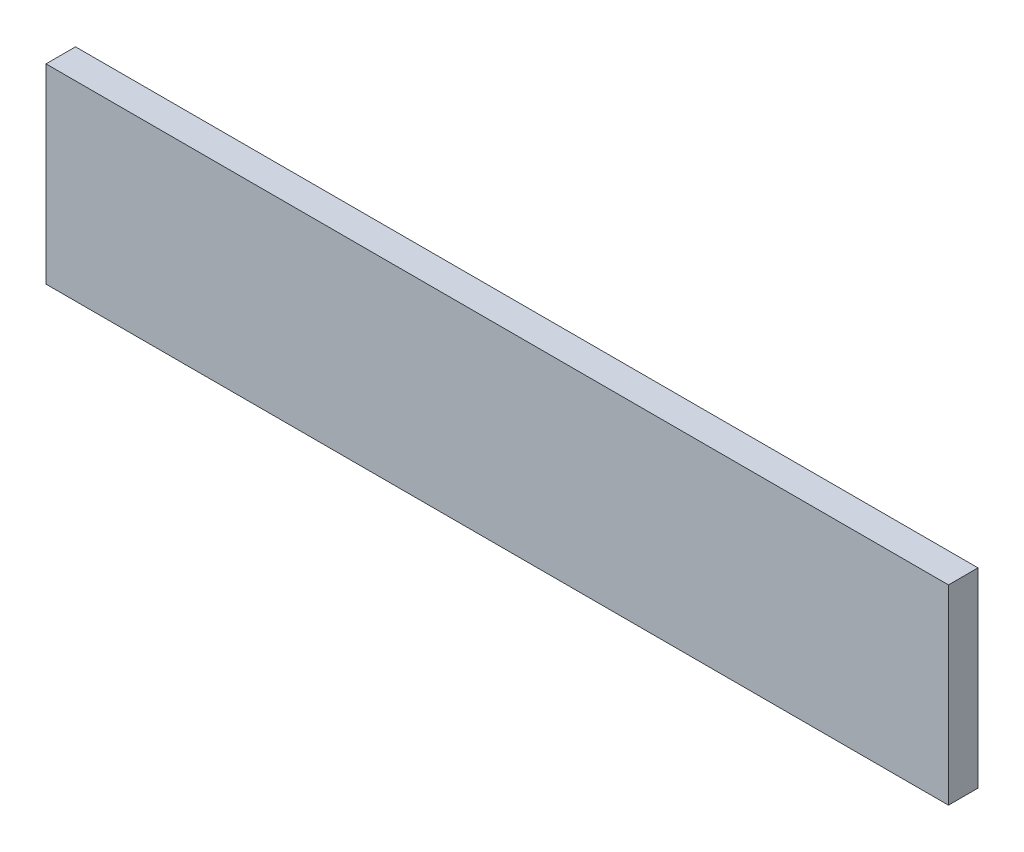
ISO-10303-21;
HEADER;
FILE_DESCRIPTION(('STEP AP214'),'2;1');
FILE_NAME('part.step','',(''),(''),'','','');
FILE_SCHEMA(('AUTOMOTIVE_DESIGN { 1 0 10303 214 1 1 1 1 }'));
ENDSEC;
DATA;
#1=APPLICATION_CONTEXT('core data for automotive mechanical design processes');
#2=APPLICATION_PROTOCOL_DEFINITION('international standard','automotive_design',2000,#1);
#3=PRODUCT_CONTEXT('',#1,'mechanical');
#4=PRODUCT('Part','Part','',(#3));
#5=PRODUCT_RELATED_PRODUCT_CATEGORY('part','',(#4));
#6=PRODUCT_DEFINITION_FORMATION('','',#4);
#7=PRODUCT_DEFINITION_CONTEXT('part definition',#1,'design');
#8=PRODUCT_DEFINITION('design','',#6,#7);
#9=PRODUCT_DEFINITION_SHAPE('','',#8);
#10=(LENGTH_UNIT() NAMED_UNIT(*) SI_UNIT(.MILLI.,.METRE.));
#11=(NAMED_UNIT(*) PLANE_ANGLE_UNIT() SI_UNIT($,.RADIAN.));
#12=(NAMED_UNIT(*) SI_UNIT($,.STERADIAN.) SOLID_ANGLE_UNIT());
#13=UNCERTAINTY_MEASURE_WITH_UNIT(LENGTH_MEASURE(1.E-05),#10,'distance_accuracy_value','');
#14=(GEOMETRIC_REPRESENTATION_CONTEXT(3) GLOBAL_UNCERTAINTY_ASSIGNED_CONTEXT((#13)) GLOBAL_UNIT_ASSIGNED_CONTEXT((#10,
#11,#12)) REPRESENTATION_CONTEXT('',''));
#15=CARTESIAN_POINT('',(0.,0.,0.));
#16=DIRECTION('',(0.,0.,1.));
#17=DIRECTION('',(1.,0.,0.));
#18=AXIS2_PLACEMENT_3D('',#15,#16,#17);
#19=CARTESIAN_POINT('',(0.,33.271694214876,3.5));
#20=DIRECTION('',(0.,1.,0.));
#21=DIRECTION('',(0.,0.,1.));
#22=AXIS2_PLACEMENT_3D('',#19,#20,#21);
#23=PLANE('',#22);
#24=DIRECTION('',(1.,0.,0.));
#25=VECTOR('',#24,1.);
#26=CARTESIAN_POINT('',(0.,33.271694214876,0.));
#27=LINE('',#26,#25);
#28=CARTESIAN_POINT('',(-40.6776859504132,33.271694214876,0.));
#29=VERTEX_POINT('',#28);
#30=CARTESIAN_POINT('',(66.3223140495868,33.271694214876,0.));
#31=VERTEX_POINT('',#30);
#32=EDGE_CURVE('E131',#29,#31,#27,.T.);
#33=ORIENTED_EDGE('',*,*,#32,.F.);
#34=DIRECTION('',(0.,0.,-1.));
#35=VECTOR('',#34,1.);
#36=CARTESIAN_POINT('',(-40.6776859504132,33.271694214876,3.5));
#37=LINE('',#36,#35);
#38=CARTESIAN_POINT('',(-40.6776859504132,33.271694214876,3.5));
#39=VERTEX_POINT('',#38);
#40=EDGE_CURVE('E89',#39,#29,#37,.T.);
#41=ORIENTED_EDGE('',*,*,#40,.F.);
#42=DIRECTION('',(1.,0.,0.));
#43=VECTOR('',#42,1.);
#44=CARTESIAN_POINT('',(0.,33.271694214876,3.5));
#45=LINE('',#44,#43);
#46=CARTESIAN_POINT('',(66.3223140495868,33.271694214876,3.5));
#47=VERTEX_POINT('',#46);
#48=EDGE_CURVE('E129',#39,#47,#45,.T.);
#49=ORIENTED_EDGE('',*,*,#48,.T.);
#50=DIRECTION('',(0.,0.,-1.));
#51=VECTOR('',#50,1.);
#52=CARTESIAN_POINT('',(66.3223140495868,33.271694214876,3.5));
#53=LINE('',#52,#51);
#54=EDGE_CURVE('E12',#47,#31,#53,.T.);
#55=ORIENTED_EDGE('',*,*,#54,.T.);
#56=EDGE_LOOP('',(#33,#41,#49,#55));
#57=FACE_BOUND('',#56,.T.);
#58=ADVANCED_FACE('F80',(#57),#23,.T.);
#59=CARTESIAN_POINT('',(-40.6776859504132,0.,3.5));
#60=DIRECTION('',(1.,0.,0.));
#61=DIRECTION('',(0.,1.,0.));
#62=AXIS2_PLACEMENT_3D('',#59,#60,#61);
#63=PLANE('',#62);
#64=DIRECTION('',(0.,-1.,0.));
#65=VECTOR('',#64,1.);
#66=CARTESIAN_POINT('',(-40.6776859504132,0.,0.));
#67=LINE('',#66,#65);
#68=CARTESIAN_POINT('',(-40.6776859504132,10.651694214876,0.));
#69=VERTEX_POINT('',#68);
#70=EDGE_CURVE('E150',#29,#69,#67,.T.);
#71=ORIENTED_EDGE('',*,*,#70,.T.);
#72=DIRECTION('',(0.,0.,-1.));
#73=VECTOR('',#72,1.);
#74=CARTESIAN_POINT('',(-40.6776859504132,10.651694214876,3.5));
#75=LINE('',#74,#73);
#76=CARTESIAN_POINT('',(-40.6776859504132,10.651694214876,3.5));
#77=VERTEX_POINT('',#76);
#78=EDGE_CURVE('E134',#77,#69,#75,.T.);
#79=ORIENTED_EDGE('',*,*,#78,.F.);
#80=DIRECTION('',(0.,-1.,0.));
#81=VECTOR('',#80,1.);
#82=CARTESIAN_POINT('',(-40.6776859504132,0.,3.5));
#83=LINE('',#82,#81);
#84=EDGE_CURVE('E136',#39,#77,#83,.T.);
#85=ORIENTED_EDGE('',*,*,#84,.F.);
#86=ORIENTED_EDGE('',*,*,#40,.T.);
#87=EDGE_LOOP('',(#71,#79,#85,#86));
#88=FACE_BOUND('',#87,.T.);
#89=ADVANCED_FACE('F137',(#88),#63,.F.);
#90=CARTESIAN_POINT('',(0.,10.651694214876,3.5));
#91=DIRECTION('',(0.,1.,0.));
#92=DIRECTION('',(0.,0.,1.));
#93=AXIS2_PLACEMENT_3D('',#90,#91,#92);
#94=PLANE('',#93);
#95=DIRECTION('',(1.,0.,0.));
#96=VECTOR('',#95,1.);
#97=CARTESIAN_POINT('',(0.,10.651694214876,0.));
#98=LINE('',#97,#96);
#99=CARTESIAN_POINT('',(66.3223140495868,10.651694214876,0.));
#100=VERTEX_POINT('',#99);
#101=EDGE_CURVE('E113',#69,#100,#98,.T.);
#102=ORIENTED_EDGE('',*,*,#101,.T.);
#103=DIRECTION('',(0.,0.,-1.));
#104=VECTOR('',#103,1.);
#105=CARTESIAN_POINT('',(66.3223140495868,10.651694214876,3.5));
#106=LINE('',#105,#104);
#107=CARTESIAN_POINT('',(66.3223140495868,10.651694214876,3.5));
#108=VERTEX_POINT('',#107);
#109=EDGE_CURVE('E120',#108,#100,#106,.T.);
#110=ORIENTED_EDGE('',*,*,#109,.F.);
#111=DIRECTION('',(1.,0.,0.));
#112=VECTOR('',#111,1.);
#113=CARTESIAN_POINT('',(0.,10.651694214876,3.5));
#114=LINE('',#113,#112);
#115=EDGE_CURVE('E97',#77,#108,#114,.T.);
#116=ORIENTED_EDGE('',*,*,#115,.F.);
#117=ORIENTED_EDGE('',*,*,#78,.T.);
#118=EDGE_LOOP('',(#102,#110,#116,#117));
#119=FACE_BOUND('',#118,.T.);
#120=ADVANCED_FACE('F155',(#119),#94,.F.);
#121=CARTESIAN_POINT('',(66.3223140495868,0.,3.5));
#122=DIRECTION('',(1.,0.,0.));
#123=DIRECTION('',(0.,1.,0.));
#124=AXIS2_PLACEMENT_3D('',#121,#122,#123);
#125=PLANE('',#124);
#126=DIRECTION('',(0.,-1.,0.));
#127=VECTOR('',#126,1.);
#128=CARTESIAN_POINT('',(66.3223140495868,0.,0.));
#129=LINE('',#128,#127);
#130=EDGE_CURVE('E146',#31,#100,#129,.T.);
#131=ORIENTED_EDGE('',*,*,#130,.F.);
#132=ORIENTED_EDGE('',*,*,#54,.F.);
#133=DIRECTION('',(0.,-1.,0.));
#134=VECTOR('',#133,1.);
#135=CARTESIAN_POINT('',(66.3223140495868,0.,3.5));
#136=LINE('',#135,#134);
#137=EDGE_CURVE('E140',#47,#108,#136,.T.);
#138=ORIENTED_EDGE('',*,*,#137,.T.);
#139=ORIENTED_EDGE('',*,*,#109,.T.);
#140=EDGE_LOOP('',(#131,#132,#138,#139));
#141=FACE_BOUND('',#140,.T.);
#142=ADVANCED_FACE('F82',(#141),#125,.T.);
#143=CARTESIAN_POINT('',(0.,0.,0.));
#144=DIRECTION('',(0.,0.,1.));
#145=DIRECTION('',(1.,0.,0.));
#146=AXIS2_PLACEMENT_3D('',#143,#144,#145);
#147=PLANE('',#146);
#148=CARTESIAN_POINT('',(50.3223140495868,17.551694214876,0.));
#149=DIRECTION('',(0.,0.,1.));
#150=DIRECTION('',(1.,0.,0.));
#151=AXIS2_PLACEMENT_3D('',#148,#149,#150);
#152=CIRCLE('',#151,3.5);
#153=CARTESIAN_POINT('',(53.8223140495868,17.551694214876,0.));
#154=VERTEX_POINT('',#153);
#155=EDGE_CURVE('E245',#154,#154,#152,.T.);
#156=ORIENTED_EDGE('',*,*,#155,.T.);
#157=EDGE_LOOP('',(#156));
#158=FACE_BOUND('',#157,.T.);
#159=CARTESIAN_POINT('',(32.3223140495868,17.551694214876,0.));
#160=DIRECTION('',(0.,0.,1.));
#161=DIRECTION('',(1.,0.,0.));
#162=AXIS2_PLACEMENT_3D('',#159,#160,#161);
#163=CIRCLE('',#162,3.5);
#164=CARTESIAN_POINT('',(35.8223140495868,17.551694214876,0.));
#165=VERTEX_POINT('',#164);
#166=EDGE_CURVE('E251',#165,#165,#163,.T.);
#167=ORIENTED_EDGE('',*,*,#166,.T.);
#168=EDGE_LOOP('',(#167));
#169=FACE_BOUND('',#168,.T.);
#170=CARTESIAN_POINT('',(14.3223140495868,17.551694214876,0.));
#171=DIRECTION('',(0.,0.,1.));
#172=DIRECTION('',(1.,0.,0.));
#173=AXIS2_PLACEMENT_3D('',#170,#171,#172);
#174=CIRCLE('',#173,3.5);
#175=CARTESIAN_POINT('',(17.8223140495868,17.551694214876,0.));
#176=VERTEX_POINT('',#175);
#177=EDGE_CURVE('E254',#176,#176,#174,.T.);
#178=ORIENTED_EDGE('',*,*,#177,.T.);
#179=EDGE_LOOP('',(#178));
#180=FACE_BOUND('',#179,.T.);
#181=ORIENTED_EDGE('',*,*,#130,.T.);
#182=ORIENTED_EDGE('',*,*,#101,.F.);
#183=ORIENTED_EDGE('',*,*,#70,.F.);
#184=ORIENTED_EDGE('',*,*,#32,.T.);
#185=EDGE_LOOP('',(#181,#182,#183,#184));
#186=FACE_BOUND('',#185,.T.);
#187=ADVANCED_FACE('F156',(#158,#169,#180,#186),#147,.F.);
#188=CARTESIAN_POINT('',(0.,0.,3.5));
#189=DIRECTION('',(0.,0.,1.));
#190=DIRECTION('',(1.,0.,0.));
#191=AXIS2_PLACEMENT_3D('',#188,#189,#190);
#192=PLANE('',#191);
#193=ORIENTED_EDGE('',*,*,#137,.F.);
#194=ORIENTED_EDGE('',*,*,#48,.F.);
#195=ORIENTED_EDGE('',*,*,#84,.T.);
#196=ORIENTED_EDGE('',*,*,#115,.T.);
#197=EDGE_LOOP('',(#193,#194,#195,#196));
#198=FACE_BOUND('',#197,.T.);
#199=ADVANCED_FACE('F139',(#198),#192,.T.);
#200=CARTESIAN_POINT('',(14.3223140495868,17.551694214876,-2.));
#201=DIRECTION('',(0.,0.,1.));
#202=DIRECTION('',(1.,0.,0.));
#203=AXIS2_PLACEMENT_3D('',#200,#201,#202);
#204=CYLINDRICAL_SURFACE('',#203,3.5);
#205=CARTESIAN_POINT('',(14.3223140495868,17.551694214876,-2.));
#206=DIRECTION('',(0.,0.,1.));
#207=DIRECTION('',(1.,0.,0.));
#208=AXIS2_PLACEMENT_3D('',#205,#206,#207);
#209=CIRCLE('',#208,3.5);
#210=CARTESIAN_POINT('',(17.8223140495868,17.551694214876,-2.));
#211=VERTEX_POINT('',#210);
#212=EDGE_CURVE('E148',#211,#211,#209,.T.);
#213=ORIENTED_EDGE('',*,*,#212,.T.);
#214=EDGE_LOOP('',(#213));
#215=FACE_BOUND('',#214,.T.);
#216=ORIENTED_EDGE('',*,*,#177,.F.);
#217=EDGE_LOOP('',(#216));
#218=FACE_BOUND('',#217,.T.);
#219=ADVANCED_FACE('F173',(#215,#218),#204,.T.);
#220=CARTESIAN_POINT('',(14.3223140495868,17.551694214876,-2.));
#221=DIRECTION('',(0.,0.,1.));
#222=DIRECTION('',(1.,0.,0.));
#223=AXIS2_PLACEMENT_3D('',#220,#221,#222);
#224=PLANE('',#223);
#225=CARTESIAN_POINT('',(14.3223140495868,17.551694214876,-2.));
#226=DIRECTION('',(0.,0.,1.));
#227=DIRECTION('',(1.,0.,0.));
#228=AXIS2_PLACEMENT_3D('',#225,#226,#227);
#229=CIRCLE('',#228,1.5);
#230=CARTESIAN_POINT('',(15.8223140495868,17.551694214876,-2.));
#231=VERTEX_POINT('',#230);
#232=EDGE_CURVE('E232',#231,#231,#229,.T.);
#233=ORIENTED_EDGE('',*,*,#232,.T.);
#234=EDGE_LOOP('',(#233));
#235=FACE_BOUND('',#234,.T.);
#236=ORIENTED_EDGE('',*,*,#212,.F.);
#237=EDGE_LOOP('',(#236));
#238=FACE_BOUND('',#237,.T.);
#239=ADVANCED_FACE('F176',(#235,#238),#224,.F.);
#240=CARTESIAN_POINT('',(32.3223140495868,17.551694214876,-2.));
#241=DIRECTION('',(0.,0.,1.));
#242=DIRECTION('',(1.,0.,0.));
#243=AXIS2_PLACEMENT_3D('',#240,#241,#242);
#244=CYLINDRICAL_SURFACE('',#243,3.5);
#245=CARTESIAN_POINT('',(32.3223140495868,17.551694214876,-2.));
#246=DIRECTION('',(0.,0.,1.));
#247=DIRECTION('',(1.,0.,0.));
#248=AXIS2_PLACEMENT_3D('',#245,#246,#247);
#249=CIRCLE('',#248,3.5);
#250=CARTESIAN_POINT('',(35.8223140495868,17.551694214876,-2.));
#251=VERTEX_POINT('',#250);
#252=EDGE_CURVE('E248',#251,#251,#249,.T.);
#253=ORIENTED_EDGE('',*,*,#252,.T.);
#254=EDGE_LOOP('',(#253));
#255=FACE_BOUND('',#254,.T.);
#256=ORIENTED_EDGE('',*,*,#166,.F.);
#257=EDGE_LOOP('',(#256));
#258=FACE_BOUND('',#257,.T.);
#259=ADVANCED_FACE('F180',(#255,#258),#244,.T.);
#260=CARTESIAN_POINT('',(32.3223140495868,17.551694214876,-2.));
#261=DIRECTION('',(0.,0.,1.));
#262=DIRECTION('',(1.,0.,0.));
#263=AXIS2_PLACEMENT_3D('',#260,#261,#262);
#264=PLANE('',#263);
#265=CARTESIAN_POINT('',(32.3223140495868,17.551694214876,-2.));
#266=DIRECTION('',(0.,0.,1.));
#267=DIRECTION('',(1.,0.,0.));
#268=AXIS2_PLACEMENT_3D('',#265,#266,#267);
#269=CIRCLE('',#268,1.5);
#270=CARTESIAN_POINT('',(33.8223140495868,17.551694214876,-2.));
#271=VERTEX_POINT('',#270);
#272=EDGE_CURVE('E225',#271,#271,#269,.T.);
#273=ORIENTED_EDGE('',*,*,#272,.T.);
#274=EDGE_LOOP('',(#273));
#275=FACE_BOUND('',#274,.T.);
#276=ORIENTED_EDGE('',*,*,#252,.F.);
#277=EDGE_LOOP('',(#276));
#278=FACE_BOUND('',#277,.T.);
#279=ADVANCED_FACE('F182',(#275,#278),#264,.F.);
#280=CARTESIAN_POINT('',(50.3223140495868,17.551694214876,-2.));
#281=DIRECTION('',(0.,0.,1.));
#282=DIRECTION('',(1.,0.,0.));
#283=AXIS2_PLACEMENT_3D('',#280,#281,#282);
#284=CYLINDRICAL_SURFACE('',#283,3.5);
#285=CARTESIAN_POINT('',(50.3223140495868,17.551694214876,-2.));
#286=DIRECTION('',(0.,0.,1.));
#287=DIRECTION('',(1.,0.,0.));
#288=AXIS2_PLACEMENT_3D('',#285,#286,#287);
#289=CIRCLE('',#288,3.5);
#290=CARTESIAN_POINT('',(53.8223140495868,17.551694214876,-2.));
#291=VERTEX_POINT('',#290);
#292=EDGE_CURVE('E243',#291,#291,#289,.T.);
#293=ORIENTED_EDGE('',*,*,#292,.T.);
#294=EDGE_LOOP('',(#293));
#295=FACE_BOUND('',#294,.T.);
#296=ORIENTED_EDGE('',*,*,#155,.F.);
#297=EDGE_LOOP('',(#296));
#298=FACE_BOUND('',#297,.T.);
#299=ADVANCED_FACE('F185',(#295,#298),#284,.T.);
#300=CARTESIAN_POINT('',(50.3223140495868,17.551694214876,-2.));
#301=DIRECTION('',(0.,0.,1.));
#302=DIRECTION('',(1.,0.,0.));
#303=AXIS2_PLACEMENT_3D('',#300,#301,#302);
#304=PLANE('',#303);
#305=CARTESIAN_POINT('',(50.3223140495868,17.551694214876,-2.));
#306=DIRECTION('',(0.,0.,1.));
#307=DIRECTION('',(1.,0.,0.));
#308=AXIS2_PLACEMENT_3D('',#305,#306,#307);
#309=CIRCLE('',#308,1.5);
#310=CARTESIAN_POINT('',(51.8223140495868,17.551694214876,-2.));
#311=VERTEX_POINT('',#310);
#312=EDGE_CURVE('E239',#311,#311,#309,.T.);
#313=ORIENTED_EDGE('',*,*,#312,.T.);
#314=EDGE_LOOP('',(#313));
#315=FACE_BOUND('',#314,.T.);
#316=ORIENTED_EDGE('',*,*,#292,.F.);
#317=EDGE_LOOP('',(#316));
#318=FACE_BOUND('',#317,.T.);
#319=ADVANCED_FACE('F190',(#315,#318),#304,.F.);
#320=CARTESIAN_POINT('',(14.3223140495868,17.551694214876,-2.));
#321=DIRECTION('',(0.,0.,1.));
#322=DIRECTION('',(1.,0.,0.));
#323=AXIS2_PLACEMENT_3D('',#320,#321,#322);
#324=CYLINDRICAL_SURFACE('',#323,1.5);
#325=ORIENTED_EDGE('',*,*,#232,.F.);
#326=EDGE_LOOP('',(#325));
#327=FACE_BOUND('',#326,.T.);
#328=CARTESIAN_POINT('',(14.3223140495868,17.551694214876,0.));
#329=DIRECTION('',(0.,0.,1.));
#330=DIRECTION('',(1.,0.,0.));
#331=AXIS2_PLACEMENT_3D('',#328,#329,#330);
#332=CIRCLE('',#331,1.5);
#333=CARTESIAN_POINT('',(15.8223140495868,17.551694214876,0.));
#334=VERTEX_POINT('',#333);
#335=EDGE_CURVE('E229',#334,#334,#332,.T.);
#336=ORIENTED_EDGE('',*,*,#335,.T.);
#337=EDGE_LOOP('',(#336));
#338=FACE_BOUND('',#337,.T.);
#339=ADVANCED_FACE('F193',(#327,#338),#324,.F.);
#340=CARTESIAN_POINT('',(14.3223140495868,17.551694214876,0.));
#341=DIRECTION('',(0.,0.,1.));
#342=DIRECTION('',(1.,0.,0.));
#343=AXIS2_PLACEMENT_3D('',#340,#341,#342);
#344=PLANE('',#343);
#345=ORIENTED_EDGE('',*,*,#335,.F.);
#346=EDGE_LOOP('',(#345));
#347=FACE_BOUND('',#346,.T.);
#348=ADVANCED_FACE('F200',(#347),#344,.F.);
#349=CARTESIAN_POINT('',(50.3223140495868,17.551694214876,-2.));
#350=DIRECTION('',(0.,0.,1.));
#351=DIRECTION('',(1.,0.,0.));
#352=AXIS2_PLACEMENT_3D('',#349,#350,#351);
#353=CYLINDRICAL_SURFACE('',#352,1.5);
#354=ORIENTED_EDGE('',*,*,#312,.F.);
#355=EDGE_LOOP('',(#354));
#356=FACE_BOUND('',#355,.T.);
#357=CARTESIAN_POINT('',(50.3223140495868,17.551694214876,0.));
#358=DIRECTION('',(0.,0.,1.));
#359=DIRECTION('',(1.,0.,0.));
#360=AXIS2_PLACEMENT_3D('',#357,#358,#359);
#361=CIRCLE('',#360,1.5);
#362=CARTESIAN_POINT('',(51.8223140495868,17.551694214876,0.));
#363=VERTEX_POINT('',#362);
#364=EDGE_CURVE('E234',#363,#363,#361,.T.);
#365=ORIENTED_EDGE('',*,*,#364,.T.);
#366=EDGE_LOOP('',(#365));
#367=FACE_BOUND('',#366,.T.);
#368=ADVANCED_FACE('F204',(#356,#367),#353,.F.);
#369=CARTESIAN_POINT('',(50.3223140495868,17.551694214876,0.));
#370=DIRECTION('',(0.,0.,1.));
#371=DIRECTION('',(1.,0.,0.));
#372=AXIS2_PLACEMENT_3D('',#369,#370,#371);
#373=PLANE('',#372);
#374=ORIENTED_EDGE('',*,*,#364,.F.);
#375=EDGE_LOOP('',(#374));
#376=FACE_BOUND('',#375,.T.);
#377=ADVANCED_FACE('F206',(#376),#373,.F.);
#378=CARTESIAN_POINT('',(32.3223140495868,17.551694214876,-2.));
#379=DIRECTION('',(0.,0.,1.));
#380=DIRECTION('',(1.,0.,0.));
#381=AXIS2_PLACEMENT_3D('',#378,#379,#380);
#382=CYLINDRICAL_SURFACE('',#381,1.5);
#383=ORIENTED_EDGE('',*,*,#272,.F.);
#384=EDGE_LOOP('',(#383));
#385=FACE_BOUND('',#384,.T.);
#386=CARTESIAN_POINT('',(32.3223140495868,17.551694214876,0.));
#387=DIRECTION('',(0.,0.,1.));
#388=DIRECTION('',(1.,0.,0.));
#389=AXIS2_PLACEMENT_3D('',#386,#387,#388);
#390=CIRCLE('',#389,1.5);
#391=CARTESIAN_POINT('',(33.8223140495868,17.551694214876,0.));
#392=VERTEX_POINT('',#391);
#393=EDGE_CURVE('E228',#392,#392,#390,.T.);
#394=ORIENTED_EDGE('',*,*,#393,.T.);
#395=EDGE_LOOP('',(#394));
#396=FACE_BOUND('',#395,.T.);
#397=ADVANCED_FACE('F209',(#385,#396),#382,.F.);
#398=CARTESIAN_POINT('',(32.3223140495868,17.551694214876,0.));
#399=DIRECTION('',(0.,0.,1.));
#400=DIRECTION('',(1.,0.,0.));
#401=AXIS2_PLACEMENT_3D('',#398,#399,#400);
#402=PLANE('',#401);
#403=ORIENTED_EDGE('',*,*,#393,.F.);
#404=EDGE_LOOP('',(#403));
#405=FACE_BOUND('',#404,.T.);
#406=ADVANCED_FACE('F214',(#405),#402,.F.);
#407=CLOSED_SHELL('',(#58,#89,#120,#142,#187,#199,#219,#239,#259,#279,#299,#319,#339,#348,#368,
#377,#397,#406));
#408=MANIFOLD_SOLID_BREP('B2',#407);
#409=ADVANCED_BREP_SHAPE_REPRESENTATION('',(#18,#408),#14);
#410=SHAPE_DEFINITION_REPRESENTATION(#9,#409);
ENDSEC;
END-ISO-10303-21;
